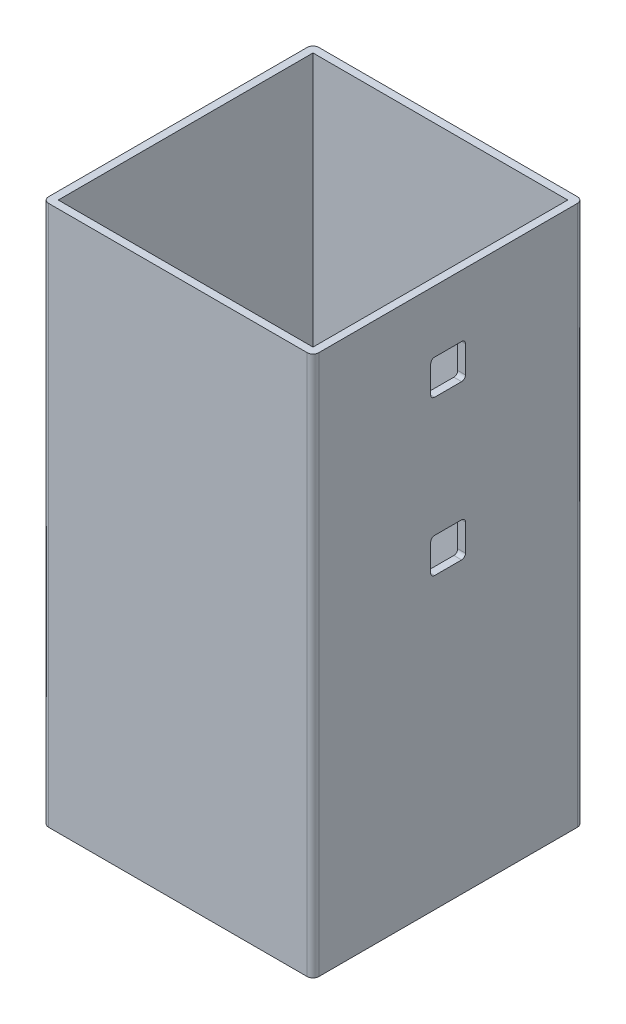
ISO-10303-21;
HEADER;
FILE_DESCRIPTION(('STEP AP214'),'2;1');
FILE_NAME('part.step','',(''),(''),'','','');
FILE_SCHEMA(('AUTOMOTIVE_DESIGN { 1 0 10303 214 1 1 1 1 }'));
ENDSEC;
DATA;
#1=APPLICATION_CONTEXT('core data for automotive mechanical design processes');
#2=APPLICATION_PROTOCOL_DEFINITION('international standard','automotive_design',2000,#1);
#3=PRODUCT_CONTEXT('',#1,'mechanical');
#4=PRODUCT('Part','Part','',(#3));
#5=PRODUCT_RELATED_PRODUCT_CATEGORY('part','',(#4));
#6=PRODUCT_DEFINITION_FORMATION('','',#4);
#7=PRODUCT_DEFINITION_CONTEXT('part definition',#1,'design');
#8=PRODUCT_DEFINITION('design','',#6,#7);
#9=PRODUCT_DEFINITION_SHAPE('','',#8);
#10=(LENGTH_UNIT() NAMED_UNIT(*) SI_UNIT(.MILLI.,.METRE.));
#11=(NAMED_UNIT(*) PLANE_ANGLE_UNIT() SI_UNIT($,.RADIAN.));
#12=(NAMED_UNIT(*) SI_UNIT($,.STERADIAN.) SOLID_ANGLE_UNIT());
#13=UNCERTAINTY_MEASURE_WITH_UNIT(LENGTH_MEASURE(1.E-05),#10,'distance_accuracy_value','');
#14=(GEOMETRIC_REPRESENTATION_CONTEXT(3) GLOBAL_UNCERTAINTY_ASSIGNED_CONTEXT((#13)) GLOBAL_UNIT_ASSIGNED_CONTEXT((#10,
#11,#12)) REPRESENTATION_CONTEXT('',''));
#15=CARTESIAN_POINT('',(0.,0.,0.));
#16=DIRECTION('',(0.,0.,1.));
#17=DIRECTION('',(1.,0.,0.));
#18=AXIS2_PLACEMENT_3D('',#15,#16,#17);
#19=CARTESIAN_POINT('',(32.,6.,3.5));
#20=DIRECTION('',(-1.,0.,0.));
#21=DIRECTION('',(0.,0.,1.));
#22=AXIS2_PLACEMENT_3D('',#19,#20,#21);
#23=CYLINDRICAL_SURFACE('',#22,1.);
#24=DIRECTION('',(1.,0.,0.));
#25=VECTOR('',#24,1.);
#26=CARTESIAN_POINT('',(32.,6.,4.5));
#27=LINE('',#26,#25);
#28=CARTESIAN_POINT('',(33.,6.,4.5));
#29=VERTEX_POINT('',#28);
#30=CARTESIAN_POINT('',(35.,6.,4.5));
#31=VERTEX_POINT('',#30);
#32=EDGE_CURVE('E179',#29,#31,#27,.T.);
#33=ORIENTED_EDGE('',*,*,#32,.T.);
#34=CARTESIAN_POINT('',(35.,6.,3.5));
#35=DIRECTION('',(-1.,0.,0.));
#36=DIRECTION('',(0.,0.,1.));
#37=AXIS2_PLACEMENT_3D('',#34,#35,#36);
#38=CIRCLE('',#37,1.);
#39=CARTESIAN_POINT('',(35.,5.,3.5));
#40=VERTEX_POINT('',#39);
#41=EDGE_CURVE('E19',#40,#31,#38,.T.);
#42=ORIENTED_EDGE('',*,*,#41,.F.);
#43=DIRECTION('',(1.,0.,0.));
#44=VECTOR('',#43,1.);
#45=CARTESIAN_POINT('',(32.,5.,3.5));
#46=LINE('',#45,#44);
#47=CARTESIAN_POINT('',(33.,5.,3.5));
#48=VERTEX_POINT('',#47);
#49=EDGE_CURVE('E273',#40,#48,#46,.F.);
#50=ORIENTED_EDGE('',*,*,#49,.T.);
#51=CARTESIAN_POINT('',(33.,6.,3.5));
#52=DIRECTION('',(-1.,0.,0.));
#53=DIRECTION('',(0.,0.,1.));
#54=AXIS2_PLACEMENT_3D('',#51,#52,#53);
#55=CIRCLE('',#54,1.);
#56=EDGE_CURVE('E177',#29,#48,#55,.F.);
#57=ORIENTED_EDGE('',*,*,#56,.F.);
#58=EDGE_LOOP('',(#33,#42,#50,#57));
#59=FACE_BOUND('',#58,.T.);
#60=ADVANCED_FACE('F16',(#59),#23,.F.);
#61=CARTESIAN_POINT('',(32.,6.,-3.5));
#62=DIRECTION('',(-1.,0.,0.));
#63=DIRECTION('',(0.,0.,1.));
#64=AXIS2_PLACEMENT_3D('',#61,#62,#63);
#65=CYLINDRICAL_SURFACE('',#64,1.);
#66=DIRECTION('',(1.,0.,0.));
#67=VECTOR('',#66,1.);
#68=CARTESIAN_POINT('',(32.,5.,-3.5));
#69=LINE('',#68,#67);
#70=CARTESIAN_POINT('',(33.,5.,-3.5));
#71=VERTEX_POINT('',#70);
#72=CARTESIAN_POINT('',(35.,5.,-3.5));
#73=VERTEX_POINT('',#72);
#74=EDGE_CURVE('E272',#71,#73,#69,.T.);
#75=ORIENTED_EDGE('',*,*,#74,.T.);
#76=CARTESIAN_POINT('',(35.,6.,-3.5));
#77=DIRECTION('',(-1.,0.,0.));
#78=DIRECTION('',(0.,0.,1.));
#79=AXIS2_PLACEMENT_3D('',#76,#77,#78);
#80=CIRCLE('',#79,1.);
#81=CARTESIAN_POINT('',(35.,6.,-4.5));
#82=VERTEX_POINT('',#81);
#83=EDGE_CURVE('E332',#82,#73,#80,.T.);
#84=ORIENTED_EDGE('',*,*,#83,.F.);
#85=DIRECTION('',(1.,0.,0.));
#86=VECTOR('',#85,1.);
#87=CARTESIAN_POINT('',(32.,6.,-4.5));
#88=LINE('',#87,#86);
#89=CARTESIAN_POINT('',(33.,6.,-4.5));
#90=VERTEX_POINT('',#89);
#91=EDGE_CURVE('E266',#82,#90,#88,.F.);
#92=ORIENTED_EDGE('',*,*,#91,.T.);
#93=CARTESIAN_POINT('',(33.,6.,-3.5));
#94=DIRECTION('',(-1.,0.,0.));
#95=DIRECTION('',(0.,0.,1.));
#96=AXIS2_PLACEMENT_3D('',#93,#94,#95);
#97=CIRCLE('',#96,1.);
#98=EDGE_CURVE('E330',#71,#90,#97,.F.);
#99=ORIENTED_EDGE('',*,*,#98,.F.);
#100=EDGE_LOOP('',(#75,#84,#92,#99));
#101=FACE_BOUND('',#100,.T.);
#102=ADVANCED_FACE('F340',(#101),#65,.F.);
#103=CARTESIAN_POINT('',(32.,13.,3.5));
#104=DIRECTION('',(-1.,0.,0.));
#105=DIRECTION('',(0.,0.,1.));
#106=AXIS2_PLACEMENT_3D('',#103,#104,#105);
#107=CYLINDRICAL_SURFACE('',#106,1.);
#108=DIRECTION('',(1.,0.,0.));
#109=VECTOR('',#108,1.);
#110=CARTESIAN_POINT('',(32.,14.,3.5));
#111=LINE('',#110,#109);
#112=CARTESIAN_POINT('',(33.,14.,3.5));
#113=VERTEX_POINT('',#112);
#114=CARTESIAN_POINT('',(35.,14.,3.5));
#115=VERTEX_POINT('',#114);
#116=EDGE_CURVE('E263',#113,#115,#111,.T.);
#117=ORIENTED_EDGE('',*,*,#116,.T.);
#118=CARTESIAN_POINT('',(35.,13.,3.5));
#119=DIRECTION('',(-1.,0.,0.));
#120=DIRECTION('',(0.,0.,1.));
#121=AXIS2_PLACEMENT_3D('',#118,#119,#120);
#122=CIRCLE('',#121,1.);
#123=CARTESIAN_POINT('',(35.,13.,4.5));
#124=VERTEX_POINT('',#123);
#125=EDGE_CURVE('E328',#124,#115,#122,.T.);
#126=ORIENTED_EDGE('',*,*,#125,.F.);
#127=DIRECTION('',(1.,0.,0.));
#128=VECTOR('',#127,1.);
#129=CARTESIAN_POINT('',(32.,13.,4.5));
#130=LINE('',#129,#128);
#131=CARTESIAN_POINT('',(33.,13.,4.5));
#132=VERTEX_POINT('',#131);
#133=EDGE_CURVE('E183',#124,#132,#130,.F.);
#134=ORIENTED_EDGE('',*,*,#133,.T.);
#135=CARTESIAN_POINT('',(33.,13.,3.5));
#136=DIRECTION('',(-1.,0.,0.));
#137=DIRECTION('',(0.,0.,1.));
#138=AXIS2_PLACEMENT_3D('',#135,#136,#137);
#139=CIRCLE('',#138,1.);
#140=EDGE_CURVE('E326',#113,#132,#139,.F.);
#141=ORIENTED_EDGE('',*,*,#140,.F.);
#142=EDGE_LOOP('',(#117,#126,#134,#141));
#143=FACE_BOUND('',#142,.T.);
#144=ADVANCED_FACE('F358',(#143),#107,.F.);
#145=CARTESIAN_POINT('',(32.,13.,-3.5));
#146=DIRECTION('',(-1.,0.,0.));
#147=DIRECTION('',(0.,0.,1.));
#148=AXIS2_PLACEMENT_3D('',#145,#146,#147);
#149=CYLINDRICAL_SURFACE('',#148,1.);
#150=DIRECTION('',(1.,0.,0.));
#151=VECTOR('',#150,1.);
#152=CARTESIAN_POINT('',(32.,13.,-4.5));
#153=LINE('',#152,#151);
#154=CARTESIAN_POINT('',(33.,13.,-4.5));
#155=VERTEX_POINT('',#154);
#156=CARTESIAN_POINT('',(35.,13.,-4.5));
#157=VERTEX_POINT('',#156);
#158=EDGE_CURVE('E269',#155,#157,#153,.T.);
#159=ORIENTED_EDGE('',*,*,#158,.T.);
#160=CARTESIAN_POINT('',(35.,13.,-3.5));
#161=DIRECTION('',(-1.,0.,0.));
#162=DIRECTION('',(0.,0.,1.));
#163=AXIS2_PLACEMENT_3D('',#160,#161,#162);
#164=CIRCLE('',#163,1.);
#165=CARTESIAN_POINT('',(35.,14.,-3.5));
#166=VERTEX_POINT('',#165);
#167=EDGE_CURVE('E324',#166,#157,#164,.T.);
#168=ORIENTED_EDGE('',*,*,#167,.F.);
#169=DIRECTION('',(1.,0.,0.));
#170=VECTOR('',#169,1.);
#171=CARTESIAN_POINT('',(32.,14.,-3.5));
#172=LINE('',#171,#170);
#173=CARTESIAN_POINT('',(33.,14.,-3.5));
#174=VERTEX_POINT('',#173);
#175=EDGE_CURVE('E258',#166,#174,#172,.F.);
#176=ORIENTED_EDGE('',*,*,#175,.T.);
#177=CARTESIAN_POINT('',(33.,13.,-3.5));
#178=DIRECTION('',(-1.,0.,0.));
#179=DIRECTION('',(0.,0.,1.));
#180=AXIS2_PLACEMENT_3D('',#177,#178,#179);
#181=CIRCLE('',#180,1.);
#182=EDGE_CURVE('E322',#155,#174,#181,.F.);
#183=ORIENTED_EDGE('',*,*,#182,.F.);
#184=EDGE_LOOP('',(#159,#168,#176,#183));
#185=FACE_BOUND('',#184,.T.);
#186=ADVANCED_FACE('F350',(#185),#149,.F.);
#187=CARTESIAN_POINT('',(32.,46.,3.5));
#188=DIRECTION('',(-1.,0.,0.));
#189=DIRECTION('',(0.,0.,1.));
#190=AXIS2_PLACEMENT_3D('',#187,#188,#189);
#191=CYLINDRICAL_SURFACE('',#190,1.);
#192=DIRECTION('',(1.,0.,0.));
#193=VECTOR('',#192,1.);
#194=CARTESIAN_POINT('',(32.,46.,4.5));
#195=LINE('',#194,#193);
#196=CARTESIAN_POINT('',(33.,46.,4.5));
#197=VERTEX_POINT('',#196);
#198=CARTESIAN_POINT('',(35.,46.,4.5));
#199=VERTEX_POINT('',#198);
#200=EDGE_CURVE('E254',#197,#199,#195,.T.);
#201=ORIENTED_EDGE('',*,*,#200,.T.);
#202=CARTESIAN_POINT('',(35.,46.,3.5));
#203=DIRECTION('',(-1.,0.,0.));
#204=DIRECTION('',(0.,0.,1.));
#205=AXIS2_PLACEMENT_3D('',#202,#203,#204);
#206=CIRCLE('',#205,1.);
#207=CARTESIAN_POINT('',(35.,45.,3.5));
#208=VERTEX_POINT('',#207);
#209=EDGE_CURVE('E320',#208,#199,#206,.T.);
#210=ORIENTED_EDGE('',*,*,#209,.F.);
#211=DIRECTION('',(1.,0.,0.));
#212=VECTOR('',#211,1.);
#213=CARTESIAN_POINT('',(32.,45.,3.5));
#214=LINE('',#213,#212);
#215=CARTESIAN_POINT('',(33.,45.,3.5));
#216=VERTEX_POINT('',#215);
#217=EDGE_CURVE('E246',#208,#216,#214,.F.);
#218=ORIENTED_EDGE('',*,*,#217,.T.);
#219=CARTESIAN_POINT('',(33.,46.,3.5));
#220=DIRECTION('',(-1.,0.,0.));
#221=DIRECTION('',(0.,0.,1.));
#222=AXIS2_PLACEMENT_3D('',#219,#220,#221);
#223=CIRCLE('',#222,1.);
#224=EDGE_CURVE('E318',#197,#216,#223,.F.);
#225=ORIENTED_EDGE('',*,*,#224,.F.);
#226=EDGE_LOOP('',(#201,#210,#218,#225));
#227=FACE_BOUND('',#226,.T.);
#228=ADVANCED_FACE('F706',(#227),#191,.F.);
#229=CARTESIAN_POINT('',(32.,46.,-3.5));
#230=DIRECTION('',(-1.,0.,0.));
#231=DIRECTION('',(0.,0.,1.));
#232=AXIS2_PLACEMENT_3D('',#229,#230,#231);
#233=CYLINDRICAL_SURFACE('',#232,1.);
#234=DIRECTION('',(1.,0.,0.));
#235=VECTOR('',#234,1.);
#236=CARTESIAN_POINT('',(32.,45.,-3.5));
#237=LINE('',#236,#235);
#238=CARTESIAN_POINT('',(33.,45.,-3.5));
#239=VERTEX_POINT('',#238);
#240=CARTESIAN_POINT('',(35.,45.,-3.5));
#241=VERTEX_POINT('',#240);
#242=EDGE_CURVE('E251',#239,#241,#237,.T.);
#243=ORIENTED_EDGE('',*,*,#242,.T.);
#244=CARTESIAN_POINT('',(35.,46.,-3.5));
#245=DIRECTION('',(-1.,0.,0.));
#246=DIRECTION('',(0.,0.,1.));
#247=AXIS2_PLACEMENT_3D('',#244,#245,#246);
#248=CIRCLE('',#247,1.);
#249=CARTESIAN_POINT('',(35.,46.,-4.5));
#250=VERTEX_POINT('',#249);
#251=EDGE_CURVE('E316',#250,#241,#248,.T.);
#252=ORIENTED_EDGE('',*,*,#251,.F.);
#253=DIRECTION('',(1.,0.,0.));
#254=VECTOR('',#253,1.);
#255=CARTESIAN_POINT('',(32.,46.,-4.5));
#256=LINE('',#255,#254);
#257=CARTESIAN_POINT('',(33.,46.,-4.5));
#258=VERTEX_POINT('',#257);
#259=EDGE_CURVE('E243',#250,#258,#256,.F.);
#260=ORIENTED_EDGE('',*,*,#259,.T.);
#261=CARTESIAN_POINT('',(33.,46.,-3.5));
#262=DIRECTION('',(-1.,0.,0.));
#263=DIRECTION('',(0.,0.,1.));
#264=AXIS2_PLACEMENT_3D('',#261,#262,#263);
#265=CIRCLE('',#264,1.);
#266=EDGE_CURVE('E314',#239,#258,#265,.F.);
#267=ORIENTED_EDGE('',*,*,#266,.F.);
#268=EDGE_LOOP('',(#243,#252,#260,#267));
#269=FACE_BOUND('',#268,.T.);
#270=ADVANCED_FACE('F696',(#269),#233,.F.);
#271=CARTESIAN_POINT('',(32.,53.,-3.5));
#272=DIRECTION('',(-1.,0.,0.));
#273=DIRECTION('',(0.,0.,1.));
#274=AXIS2_PLACEMENT_3D('',#271,#272,#273);
#275=CYLINDRICAL_SURFACE('',#274,1.);
#276=DIRECTION('',(1.,0.,0.));
#277=VECTOR('',#276,1.);
#278=CARTESIAN_POINT('',(32.,53.,-4.5));
#279=LINE('',#278,#277);
#280=CARTESIAN_POINT('',(33.,53.,-4.5));
#281=VERTEX_POINT('',#280);
#282=CARTESIAN_POINT('',(35.,53.,-4.5));
#283=VERTEX_POINT('',#282);
#284=EDGE_CURVE('E240',#281,#283,#279,.T.);
#285=ORIENTED_EDGE('',*,*,#284,.T.);
#286=CARTESIAN_POINT('',(35.,53.,-3.5));
#287=DIRECTION('',(-1.,0.,0.));
#288=DIRECTION('',(0.,0.,1.));
#289=AXIS2_PLACEMENT_3D('',#286,#287,#288);
#290=CIRCLE('',#289,1.);
#291=CARTESIAN_POINT('',(35.,54.,-3.5));
#292=VERTEX_POINT('',#291);
#293=EDGE_CURVE('E312',#292,#283,#290,.T.);
#294=ORIENTED_EDGE('',*,*,#293,.F.);
#295=DIRECTION('',(1.,0.,0.));
#296=VECTOR('',#295,1.);
#297=CARTESIAN_POINT('',(32.,54.,-3.5));
#298=LINE('',#297,#296);
#299=CARTESIAN_POINT('',(33.,54.,-3.5));
#300=VERTEX_POINT('',#299);
#301=EDGE_CURVE('E237',#292,#300,#298,.F.);
#302=ORIENTED_EDGE('',*,*,#301,.T.);
#303=CARTESIAN_POINT('',(33.,53.,-3.5));
#304=DIRECTION('',(-1.,0.,0.));
#305=DIRECTION('',(0.,0.,1.));
#306=AXIS2_PLACEMENT_3D('',#303,#304,#305);
#307=CIRCLE('',#306,1.);
#308=EDGE_CURVE('E310',#281,#300,#307,.F.);
#309=ORIENTED_EDGE('',*,*,#308,.F.);
#310=EDGE_LOOP('',(#285,#294,#302,#309));
#311=FACE_BOUND('',#310,.T.);
#312=ADVANCED_FACE('F686',(#311),#275,.F.);
#313=CARTESIAN_POINT('',(32.,53.,3.5));
#314=DIRECTION('',(-1.,0.,0.));
#315=DIRECTION('',(0.,0.,1.));
#316=AXIS2_PLACEMENT_3D('',#313,#314,#315);
#317=CYLINDRICAL_SURFACE('',#316,1.);
#318=DIRECTION('',(1.,0.,0.));
#319=VECTOR('',#318,1.);
#320=CARTESIAN_POINT('',(32.,54.,3.5));
#321=LINE('',#320,#319);
#322=CARTESIAN_POINT('',(33.,54.,3.5));
#323=VERTEX_POINT('',#322);
#324=CARTESIAN_POINT('',(35.,54.,3.5));
#325=VERTEX_POINT('',#324);
#326=EDGE_CURVE('E236',#323,#325,#321,.T.);
#327=ORIENTED_EDGE('',*,*,#326,.T.);
#328=CARTESIAN_POINT('',(35.,53.,3.5));
#329=DIRECTION('',(-1.,0.,0.));
#330=DIRECTION('',(0.,0.,1.));
#331=AXIS2_PLACEMENT_3D('',#328,#329,#330);
#332=CIRCLE('',#331,1.);
#333=CARTESIAN_POINT('',(35.,53.,4.5));
#334=VERTEX_POINT('',#333);
#335=EDGE_CURVE('E308',#334,#325,#332,.T.);
#336=ORIENTED_EDGE('',*,*,#335,.F.);
#337=DIRECTION('',(1.,0.,0.));
#338=VECTOR('',#337,1.);
#339=CARTESIAN_POINT('',(32.,53.,4.5));
#340=LINE('',#339,#338);
#341=CARTESIAN_POINT('',(33.,53.,4.5));
#342=VERTEX_POINT('',#341);
#343=EDGE_CURVE('E255',#334,#342,#340,.F.);
#344=ORIENTED_EDGE('',*,*,#343,.T.);
#345=CARTESIAN_POINT('',(33.,53.,3.5));
#346=DIRECTION('',(-1.,0.,0.));
#347=DIRECTION('',(0.,0.,1.));
#348=AXIS2_PLACEMENT_3D('',#345,#346,#347);
#349=CIRCLE('',#348,1.);
#350=EDGE_CURVE('E184',#323,#342,#349,.F.);
#351=ORIENTED_EDGE('',*,*,#350,.F.);
#352=EDGE_LOOP('',(#327,#336,#344,#351));
#353=FACE_BOUND('',#352,.T.);
#354=ADVANCED_FACE('F677',(#353),#317,.F.);
#355=CARTESIAN_POINT('',(32.,14.,4.5));
#356=DIRECTION('',(0.,0.,1.));
#357=DIRECTION('',(1.,0.,0.));
#358=AXIS2_PLACEMENT_3D('',#355,#356,#357);
#359=PLANE('',#358);
#360=ORIENTED_EDGE('',*,*,#133,.F.);
#361=DIRECTION('',(0.,1.,0.));
#362=VECTOR('',#361,1.);
#363=CARTESIAN_POINT('',(35.,70.,4.5));
#364=LINE('',#363,#362);
#365=EDGE_CURVE('E174',#124,#31,#364,.F.);
#366=ORIENTED_EDGE('',*,*,#365,.T.);
#367=ORIENTED_EDGE('',*,*,#32,.F.);
#368=DIRECTION('',(0.,1.,0.));
#369=VECTOR('',#368,1.);
#370=CARTESIAN_POINT('',(33.,-70.,4.5));
#371=LINE('',#370,#369);
#372=EDGE_CURVE('E222',#29,#132,#371,.T.);
#373=ORIENTED_EDGE('',*,*,#372,.T.);
#374=EDGE_LOOP('',(#360,#366,#367,#373));
#375=FACE_BOUND('',#374,.T.);
#376=ADVANCED_FACE('F187',(#375),#359,.F.);
#377=CARTESIAN_POINT('',(32.,5.,4.5));
#378=DIRECTION('',(0.,-1.,0.));
#379=DIRECTION('',(0.,0.,-1.));
#380=AXIS2_PLACEMENT_3D('',#377,#378,#379);
#381=PLANE('',#380);
#382=ORIENTED_EDGE('',*,*,#74,.F.);
#383=DIRECTION('',(0.,0.,-1.));
#384=VECTOR('',#383,1.);
#385=CARTESIAN_POINT('',(33.,5.,-33.));
#386=LINE('',#385,#384);
#387=EDGE_CURVE('E224',#71,#48,#386,.F.);
#388=ORIENTED_EDGE('',*,*,#387,.T.);
#389=ORIENTED_EDGE('',*,*,#49,.F.);
#390=DIRECTION('',(0.,0.,1.));
#391=VECTOR('',#390,1.);
#392=CARTESIAN_POINT('',(35.,5.,-35.));
#393=LINE('',#392,#391);
#394=EDGE_CURVE('E176',#40,#73,#393,.F.);
#395=ORIENTED_EDGE('',*,*,#394,.T.);
#396=EDGE_LOOP('',(#382,#388,#389,#395));
#397=FACE_BOUND('',#396,.T.);
#398=ADVANCED_FACE('F338',(#397),#381,.F.);
#399=CARTESIAN_POINT('',(32.,14.,-4.5));
#400=DIRECTION('',(0.,0.,-1.));
#401=DIRECTION('',(0.,1.,0.));
#402=AXIS2_PLACEMENT_3D('',#399,#400,#401);
#403=PLANE('',#402);
#404=ORIENTED_EDGE('',*,*,#91,.F.);
#405=DIRECTION('',(0.,1.,0.));
#406=VECTOR('',#405,1.);
#407=CARTESIAN_POINT('',(35.,70.,-4.5));
#408=LINE('',#407,#406);
#409=EDGE_CURVE('E191',#82,#157,#408,.T.);
#410=ORIENTED_EDGE('',*,*,#409,.T.);
#411=ORIENTED_EDGE('',*,*,#158,.F.);
#412=DIRECTION('',(0.,1.,0.));
#413=VECTOR('',#412,1.);
#414=CARTESIAN_POINT('',(33.,-70.,-4.5));
#415=LINE('',#414,#413);
#416=EDGE_CURVE('E227',#155,#90,#415,.F.);
#417=ORIENTED_EDGE('',*,*,#416,.T.);
#418=EDGE_LOOP('',(#404,#410,#411,#417));
#419=FACE_BOUND('',#418,.T.);
#420=ADVANCED_FACE('F346',(#419),#403,.F.);
#421=CARTESIAN_POINT('',(32.,14.,4.5));
#422=DIRECTION('',(0.,1.,0.));
#423=DIRECTION('',(0.,0.,1.));
#424=AXIS2_PLACEMENT_3D('',#421,#422,#423);
#425=PLANE('',#424);
#426=ORIENTED_EDGE('',*,*,#175,.F.);
#427=DIRECTION('',(0.,0.,1.));
#428=VECTOR('',#427,1.);
#429=CARTESIAN_POINT('',(35.,14.,-35.));
#430=LINE('',#429,#428);
#431=EDGE_CURVE('E359',#166,#115,#430,.T.);
#432=ORIENTED_EDGE('',*,*,#431,.T.);
#433=ORIENTED_EDGE('',*,*,#116,.F.);
#434=DIRECTION('',(0.,0.,-1.));
#435=VECTOR('',#434,1.);
#436=CARTESIAN_POINT('',(33.,14.,-33.));
#437=LINE('',#436,#435);
#438=EDGE_CURVE('E230',#113,#174,#437,.T.);
#439=ORIENTED_EDGE('',*,*,#438,.T.);
#440=EDGE_LOOP('',(#426,#432,#433,#439));
#441=FACE_BOUND('',#440,.T.);
#442=ADVANCED_FACE('F356',(#441),#425,.F.);
#443=CARTESIAN_POINT('',(32.,54.,4.5));
#444=DIRECTION('',(0.,0.,1.));
#445=DIRECTION('',(0.,-1.,0.));
#446=AXIS2_PLACEMENT_3D('',#443,#444,#445);
#447=PLANE('',#446);
#448=ORIENTED_EDGE('',*,*,#200,.F.);
#449=DIRECTION('',(0.,1.,0.));
#450=VECTOR('',#449,1.);
#451=CARTESIAN_POINT('',(33.,-70.,4.5));
#452=LINE('',#451,#450);
#453=EDGE_CURVE('E210',#197,#342,#452,.T.);
#454=ORIENTED_EDGE('',*,*,#453,.T.);
#455=ORIENTED_EDGE('',*,*,#343,.F.);
#456=DIRECTION('',(0.,1.,0.));
#457=VECTOR('',#456,1.);
#458=CARTESIAN_POINT('',(35.,70.,4.5));
#459=LINE('',#458,#457);
#460=EDGE_CURVE('E360',#334,#199,#459,.F.);
#461=ORIENTED_EDGE('',*,*,#460,.T.);
#462=EDGE_LOOP('',(#448,#454,#455,#461));
#463=FACE_BOUND('',#462,.T.);
#464=ADVANCED_FACE('F634',(#463),#447,.F.);
#465=CARTESIAN_POINT('',(32.,45.,4.5));
#466=DIRECTION('',(0.,-1.,0.));
#467=DIRECTION('',(0.,0.,-1.));
#468=AXIS2_PLACEMENT_3D('',#465,#466,#467);
#469=PLANE('',#468);
#470=ORIENTED_EDGE('',*,*,#217,.F.);
#471=DIRECTION('',(0.,0.,1.));
#472=VECTOR('',#471,1.);
#473=CARTESIAN_POINT('',(35.,45.,-35.));
#474=LINE('',#473,#472);
#475=EDGE_CURVE('E363',#208,#241,#474,.F.);
#476=ORIENTED_EDGE('',*,*,#475,.T.);
#477=ORIENTED_EDGE('',*,*,#242,.F.);
#478=DIRECTION('',(0.,0.,-1.));
#479=VECTOR('',#478,1.);
#480=CARTESIAN_POINT('',(33.,45.,-33.));
#481=LINE('',#480,#479);
#482=EDGE_CURVE('E213',#239,#216,#481,.F.);
#483=ORIENTED_EDGE('',*,*,#482,.T.);
#484=EDGE_LOOP('',(#470,#476,#477,#483));
#485=FACE_BOUND('',#484,.T.);
#486=ADVANCED_FACE('F624',(#485),#469,.F.);
#487=CARTESIAN_POINT('',(32.,54.,-4.5));
#488=DIRECTION('',(0.,0.,-1.));
#489=DIRECTION('',(0.,1.,0.));
#490=AXIS2_PLACEMENT_3D('',#487,#488,#489);
#491=PLANE('',#490);
#492=ORIENTED_EDGE('',*,*,#284,.F.);
#493=DIRECTION('',(0.,1.,0.));
#494=VECTOR('',#493,1.);
#495=CARTESIAN_POINT('',(33.,-70.,-4.5));
#496=LINE('',#495,#494);
#497=EDGE_CURVE('E216',#281,#258,#496,.F.);
#498=ORIENTED_EDGE('',*,*,#497,.T.);
#499=ORIENTED_EDGE('',*,*,#259,.F.);
#500=DIRECTION('',(0.,1.,0.));
#501=VECTOR('',#500,1.);
#502=CARTESIAN_POINT('',(35.,70.,-4.5));
#503=LINE('',#502,#501);
#504=EDGE_CURVE('E368',#250,#283,#503,.T.);
#505=ORIENTED_EDGE('',*,*,#504,.T.);
#506=EDGE_LOOP('',(#492,#498,#499,#505));
#507=FACE_BOUND('',#506,.T.);
#508=ADVANCED_FACE('F614',(#507),#491,.F.);
#509=CARTESIAN_POINT('',(32.,54.,4.5));
#510=DIRECTION('',(0.,1.,0.));
#511=DIRECTION('',(0.,0.,1.));
#512=AXIS2_PLACEMENT_3D('',#509,#510,#511);
#513=PLANE('',#512);
#514=ORIENTED_EDGE('',*,*,#326,.F.);
#515=DIRECTION('',(0.,0.,-1.));
#516=VECTOR('',#515,1.);
#517=CARTESIAN_POINT('',(33.,54.,-33.));
#518=LINE('',#517,#516);
#519=EDGE_CURVE('E219',#323,#300,#518,.T.);
#520=ORIENTED_EDGE('',*,*,#519,.T.);
#521=ORIENTED_EDGE('',*,*,#301,.F.);
#522=DIRECTION('',(0.,0.,1.));
#523=VECTOR('',#522,1.);
#524=CARTESIAN_POINT('',(35.,54.,-35.));
#525=LINE('',#524,#523);
#526=EDGE_CURVE('E200',#292,#325,#525,.T.);
#527=ORIENTED_EDGE('',*,*,#526,.T.);
#528=EDGE_LOOP('',(#514,#520,#521,#527));
#529=FACE_BOUND('',#528,.T.);
#530=ADVANCED_FACE('F506',(#529),#513,.F.);
#531=CARTESIAN_POINT('',(-33.,-70.,-33.));
#532=DIRECTION('',(-1.,0.,0.));
#533=DIRECTION('',(0.,0.,1.));
#534=AXIS2_PLACEMENT_3D('',#531,#532,#533);
#535=PLANE('',#534);
#536=DIRECTION('',(0.,0.,-1.));
#537=VECTOR('',#536,1.);
#538=CARTESIAN_POINT('',(-33.,-70.,0.));
#539=LINE('',#538,#537);
#540=CARTESIAN_POINT('',(-33.,-70.,-33.));
#541=VERTEX_POINT('',#540);
#542=CARTESIAN_POINT('',(-33.,-70.,33.));
#543=VERTEX_POINT('',#542);
#544=EDGE_CURVE('E375',#541,#543,#539,.F.);
#545=ORIENTED_EDGE('',*,*,#544,.F.);
#546=DIRECTION('',(0.,1.,0.));
#547=VECTOR('',#546,1.);
#548=CARTESIAN_POINT('',(-33.,-70.,-33.));
#549=LINE('',#548,#547);
#550=CARTESIAN_POINT('',(-33.,70.,-33.));
#551=VERTEX_POINT('',#550);
#552=EDGE_CURVE('E193',#541,#551,#549,.T.);
#553=ORIENTED_EDGE('',*,*,#552,.T.);
#554=DIRECTION('',(0.,0.,-1.));
#555=VECTOR('',#554,1.);
#556=CARTESIAN_POINT('',(-33.,70.,0.));
#557=LINE('',#556,#555);
#558=CARTESIAN_POINT('',(-33.,70.,33.));
#559=VERTEX_POINT('',#558);
#560=EDGE_CURVE('E389',#551,#559,#557,.F.);
#561=ORIENTED_EDGE('',*,*,#560,.T.);
#562=DIRECTION('',(0.,1.,0.));
#563=VECTOR('',#562,1.);
#564=CARTESIAN_POINT('',(-33.,-70.,33.));
#565=LINE('',#564,#563);
#566=EDGE_CURVE('E233',#559,#543,#565,.F.);
#567=ORIENTED_EDGE('',*,*,#566,.T.);
#568=EDGE_LOOP('',(#545,#553,#561,#567));
#569=FACE_BOUND('',#568,.T.);
#570=ADVANCED_FACE('F493',(#569),#535,.F.);
#571=CARTESIAN_POINT('',(33.,-70.,33.));
#572=DIRECTION('',(0.,0.,1.));
#573=DIRECTION('',(1.,0.,0.));
#574=AXIS2_PLACEMENT_3D('',#571,#572,#573);
#575=PLANE('',#574);
#576=DIRECTION('',(1.,0.,0.));
#577=VECTOR('',#576,1.);
#578=CARTESIAN_POINT('',(0.,-70.,33.));
#579=LINE('',#578,#577);
#580=CARTESIAN_POINT('',(33.,-70.,33.));
#581=VERTEX_POINT('',#580);
#582=EDGE_CURVE('E408',#543,#581,#579,.T.);
#583=ORIENTED_EDGE('',*,*,#582,.F.);
#584=ORIENTED_EDGE('',*,*,#566,.F.);
#585=DIRECTION('',(1.,0.,0.));
#586=VECTOR('',#585,1.);
#587=CARTESIAN_POINT('',(0.,70.,33.));
#588=LINE('',#587,#586);
#589=CARTESIAN_POINT('',(33.,70.,33.));
#590=VERTEX_POINT('',#589);
#591=EDGE_CURVE('E306',#559,#590,#588,.T.);
#592=ORIENTED_EDGE('',*,*,#591,.T.);
#593=DIRECTION('',(0.,1.,0.));
#594=VECTOR('',#593,1.);
#595=CARTESIAN_POINT('',(33.,-70.,33.));
#596=LINE('',#595,#594);
#597=EDGE_CURVE('E207',#590,#581,#596,.F.);
#598=ORIENTED_EDGE('',*,*,#597,.T.);
#599=EDGE_LOOP('',(#583,#584,#592,#598));
#600=FACE_BOUND('',#599,.T.);
#601=ADVANCED_FACE('F496',(#600),#575,.F.);
#602=CARTESIAN_POINT('',(33.,-70.,-33.));
#603=DIRECTION('',(1.,0.,0.));
#604=DIRECTION('',(0.,0.,-1.));
#605=AXIS2_PLACEMENT_3D('',#602,#603,#604);
#606=PLANE('',#605);
#607=DIRECTION('',(0.,0.,-1.));
#608=VECTOR('',#607,1.);
#609=CARTESIAN_POINT('',(33.,-70.,0.));
#610=LINE('',#609,#608);
#611=CARTESIAN_POINT('',(33.,-70.,-33.));
#612=VERTEX_POINT('',#611);
#613=EDGE_CURVE('E411',#581,#612,#610,.T.);
#614=ORIENTED_EDGE('',*,*,#613,.F.);
#615=ORIENTED_EDGE('',*,*,#597,.F.);
#616=DIRECTION('',(0.,0.,-1.));
#617=VECTOR('',#616,1.);
#618=CARTESIAN_POINT('',(33.,70.,0.));
#619=LINE('',#618,#617);
#620=CARTESIAN_POINT('',(33.,70.,-33.));
#621=VERTEX_POINT('',#620);
#622=EDGE_CURVE('E379',#590,#621,#619,.T.);
#623=ORIENTED_EDGE('',*,*,#622,.T.);
#624=DIRECTION('',(0.,1.,0.));
#625=VECTOR('',#624,1.);
#626=CARTESIAN_POINT('',(33.,-70.,-33.));
#627=LINE('',#626,#625);
#628=EDGE_CURVE('E204',#621,#612,#627,.F.);
#629=ORIENTED_EDGE('',*,*,#628,.T.);
#630=EDGE_LOOP('',(#614,#615,#623,#629));
#631=FACE_BOUND('',#630,.T.);
#632=ORIENTED_EDGE('',*,*,#224,.T.);
#633=ORIENTED_EDGE('',*,*,#482,.F.);
#634=ORIENTED_EDGE('',*,*,#266,.T.);
#635=ORIENTED_EDGE('',*,*,#497,.F.);
#636=ORIENTED_EDGE('',*,*,#308,.T.);
#637=ORIENTED_EDGE('',*,*,#519,.F.);
#638=ORIENTED_EDGE('',*,*,#350,.T.);
#639=ORIENTED_EDGE('',*,*,#453,.F.);
#640=EDGE_LOOP('',(#632,#633,#634,#635,#636,#637,#638,#639));
#641=FACE_BOUND('',#640,.T.);
#642=ORIENTED_EDGE('',*,*,#56,.T.);
#643=ORIENTED_EDGE('',*,*,#387,.F.);
#644=ORIENTED_EDGE('',*,*,#98,.T.);
#645=ORIENTED_EDGE('',*,*,#416,.F.);
#646=ORIENTED_EDGE('',*,*,#182,.T.);
#647=ORIENTED_EDGE('',*,*,#438,.F.);
#648=ORIENTED_EDGE('',*,*,#140,.T.);
#649=ORIENTED_EDGE('',*,*,#372,.F.);
#650=EDGE_LOOP('',(#642,#643,#644,#645,#646,#647,#648,#649));
#651=FACE_BOUND('',#650,.T.);
#652=ADVANCED_FACE('F335',(#631,#641,#651),#606,.F.);
#653=CARTESIAN_POINT('',(33.,-70.,-33.));
#654=DIRECTION('',(0.,0.,-1.));
#655=DIRECTION('',(-1.,0.,0.));
#656=AXIS2_PLACEMENT_3D('',#653,#654,#655);
#657=PLANE('',#656);
#658=DIRECTION('',(1.,0.,0.));
#659=VECTOR('',#658,1.);
#660=CARTESIAN_POINT('',(0.,-70.,-33.));
#661=LINE('',#660,#659);
#662=EDGE_CURVE('E414',#612,#541,#661,.F.);
#663=ORIENTED_EDGE('',*,*,#662,.F.);
#664=ORIENTED_EDGE('',*,*,#628,.F.);
#665=DIRECTION('',(1.,0.,0.));
#666=VECTOR('',#665,1.);
#667=CARTESIAN_POINT('',(0.,70.,-33.));
#668=LINE('',#667,#666);
#669=EDGE_CURVE('E386',#621,#551,#668,.F.);
#670=ORIENTED_EDGE('',*,*,#669,.T.);
#671=ORIENTED_EDGE('',*,*,#552,.F.);
#672=EDGE_LOOP('',(#663,#664,#670,#671));
#673=FACE_BOUND('',#672,.T.);
#674=ADVANCED_FACE('F490',(#673),#657,.F.);
#675=CARTESIAN_POINT('',(35.,70.,-35.));
#676=DIRECTION('',(0.,0.,1.));
#677=DIRECTION('',(1.,0.,0.));
#678=AXIS2_PLACEMENT_3D('',#675,#676,#677);
#679=PLANE('',#678);
#680=DIRECTION('',(0.,-1.,0.));
#681=VECTOR('',#680,1.);
#682=CARTESIAN_POINT('',(33.5,70.,-35.));
#683=LINE('',#682,#681);
#684=CARTESIAN_POINT('',(33.5,-70.,-35.));
#685=VERTEX_POINT('',#684);
#686=CARTESIAN_POINT('',(33.5,70.,-35.));
#687=VERTEX_POINT('',#686);
#688=EDGE_CURVE('E189',#685,#687,#683,.F.);
#689=ORIENTED_EDGE('',*,*,#688,.F.);
#690=DIRECTION('',(1.,0.,0.));
#691=VECTOR('',#690,1.);
#692=CARTESIAN_POINT('',(0.,-70.,-35.));
#693=LINE('',#692,#691);
#694=CARTESIAN_POINT('',(-33.5,-70.,-35.));
#695=VERTEX_POINT('',#694);
#696=EDGE_CURVE('E290',#695,#685,#693,.T.);
#697=ORIENTED_EDGE('',*,*,#696,.F.);
#698=DIRECTION('',(0.,-1.,0.));
#699=VECTOR('',#698,1.);
#700=CARTESIAN_POINT('',(-33.5,70.,-35.));
#701=LINE('',#700,#699);
#702=CARTESIAN_POINT('',(-33.5,70.,-35.));
#703=VERTEX_POINT('',#702);
#704=EDGE_CURVE('E199',#703,#695,#701,.T.);
#705=ORIENTED_EDGE('',*,*,#704,.F.);
#706=DIRECTION('',(1.,0.,0.));
#707=VECTOR('',#706,1.);
#708=CARTESIAN_POINT('',(0.,70.,-35.));
#709=LINE('',#708,#707);
#710=EDGE_CURVE('E298',#703,#687,#709,.T.);
#711=ORIENTED_EDGE('',*,*,#710,.T.);
#712=EDGE_LOOP('',(#689,#697,#705,#711));
#713=FACE_BOUND('',#712,.T.);
#714=ADVANCED_FACE('F441',(#713),#679,.F.);
#715=CARTESIAN_POINT('',(33.5,70.,-33.5));
#716=DIRECTION('',(0.,-1.,0.));
#717=DIRECTION('',(0.,0.,-1.));
#718=AXIS2_PLACEMENT_3D('',#715,#716,#717);
#719=CYLINDRICAL_SURFACE('',#718,1.5);
#720=CARTESIAN_POINT('',(33.5,-70.,-33.5));
#721=DIRECTION('',(0.,-1.,0.));
#722=DIRECTION('',(0.,0.,-1.));
#723=AXIS2_PLACEMENT_3D('',#720,#721,#722);
#724=CIRCLE('',#723,1.5);
#725=CARTESIAN_POINT('',(35.,-70.,-33.5));
#726=VERTEX_POINT('',#725);
#727=EDGE_CURVE('E288',#685,#726,#724,.T.);
#728=ORIENTED_EDGE('',*,*,#727,.F.);
#729=ORIENTED_EDGE('',*,*,#688,.T.);
#730=CARTESIAN_POINT('',(33.5,70.,-33.5));
#731=DIRECTION('',(0.,-1.,0.));
#732=DIRECTION('',(0.,0.,-1.));
#733=AXIS2_PLACEMENT_3D('',#730,#731,#732);
#734=CIRCLE('',#733,1.5);
#735=CARTESIAN_POINT('',(35.,70.,-33.5));
#736=VERTEX_POINT('',#735);
#737=EDGE_CURVE('E295',#687,#736,#734,.T.);
#738=ORIENTED_EDGE('',*,*,#737,.T.);
#739=DIRECTION('',(0.,1.,0.));
#740=VECTOR('',#739,1.);
#741=CARTESIAN_POINT('',(35.,70.,-33.5));
#742=LINE('',#741,#740);
#743=EDGE_CURVE('E197',#736,#726,#742,.F.);
#744=ORIENTED_EDGE('',*,*,#743,.T.);
#745=EDGE_LOOP('',(#728,#729,#738,#744));
#746=FACE_BOUND('',#745,.T.);
#747=ADVANCED_FACE('F450',(#746),#719,.T.);
#748=CARTESIAN_POINT('',(35.,70.,-35.));
#749=DIRECTION('',(-1.,0.,0.));
#750=DIRECTION('',(0.,0.,1.));
#751=AXIS2_PLACEMENT_3D('',#748,#749,#750);
#752=PLANE('',#751);
#753=ORIENTED_EDGE('',*,*,#743,.F.);
#754=DIRECTION('',(0.,0.,-1.));
#755=VECTOR('',#754,1.);
#756=CARTESIAN_POINT('',(35.,70.,0.));
#757=LINE('',#756,#755);
#758=CARTESIAN_POINT('',(35.,70.,33.5));
#759=VERTEX_POINT('',#758);
#760=EDGE_CURVE('E294',#736,#759,#757,.F.);
#761=ORIENTED_EDGE('',*,*,#760,.T.);
#762=DIRECTION('',(0.,-1.,0.));
#763=VECTOR('',#762,1.);
#764=CARTESIAN_POINT('',(35.,70.,33.5));
#765=LINE('',#764,#763);
#766=CARTESIAN_POINT('',(35.,-70.,33.5));
#767=VERTEX_POINT('',#766);
#768=EDGE_CURVE('E293',#767,#759,#765,.F.);
#769=ORIENTED_EDGE('',*,*,#768,.F.);
#770=DIRECTION('',(0.,0.,-1.));
#771=VECTOR('',#770,1.);
#772=CARTESIAN_POINT('',(35.,-70.,0.));
#773=LINE('',#772,#771);
#774=EDGE_CURVE('E287',#726,#767,#773,.F.);
#775=ORIENTED_EDGE('',*,*,#774,.F.);
#776=EDGE_LOOP('',(#753,#761,#769,#775));
#777=FACE_BOUND('',#776,.T.);
#778=ORIENTED_EDGE('',*,*,#293,.T.);
#779=ORIENTED_EDGE('',*,*,#504,.F.);
#780=ORIENTED_EDGE('',*,*,#251,.T.);
#781=ORIENTED_EDGE('',*,*,#475,.F.);
#782=ORIENTED_EDGE('',*,*,#209,.T.);
#783=ORIENTED_EDGE('',*,*,#460,.F.);
#784=ORIENTED_EDGE('',*,*,#335,.T.);
#785=ORIENTED_EDGE('',*,*,#526,.F.);
#786=EDGE_LOOP('',(#778,#779,#780,#781,#782,#783,#784,#785));
#787=FACE_BOUND('',#786,.T.);
#788=ORIENTED_EDGE('',*,*,#167,.T.);
#789=ORIENTED_EDGE('',*,*,#409,.F.);
#790=ORIENTED_EDGE('',*,*,#83,.T.);
#791=ORIENTED_EDGE('',*,*,#394,.F.);
#792=ORIENTED_EDGE('',*,*,#41,.T.);
#793=ORIENTED_EDGE('',*,*,#365,.F.);
#794=ORIENTED_EDGE('',*,*,#125,.T.);
#795=ORIENTED_EDGE('',*,*,#431,.F.);
#796=EDGE_LOOP('',(#788,#789,#790,#791,#792,#793,#794,#795));
#797=FACE_BOUND('',#796,.T.);
#798=ADVANCED_FACE('F172',(#777,#787,#797),#752,.F.);
#799=CARTESIAN_POINT('',(-35.,70.,-35.));
#800=DIRECTION('',(1.,0.,0.));
#801=DIRECTION('',(0.,0.,-1.));
#802=AXIS2_PLACEMENT_3D('',#799,#800,#801);
#803=PLANE('',#802);
#804=DIRECTION('',(0.,-1.,0.));
#805=VECTOR('',#804,1.);
#806=CARTESIAN_POINT('',(-35.,70.,-33.5));
#807=LINE('',#806,#805);
#808=CARTESIAN_POINT('',(-35.,-70.,-33.5));
#809=VERTEX_POINT('',#808);
#810=CARTESIAN_POINT('',(-35.,70.,-33.5));
#811=VERTEX_POINT('',#810);
#812=EDGE_CURVE('E380',#809,#811,#807,.F.);
#813=ORIENTED_EDGE('',*,*,#812,.F.);
#814=DIRECTION('',(0.,0.,-1.));
#815=VECTOR('',#814,1.);
#816=CARTESIAN_POINT('',(-35.,-70.,0.));
#817=LINE('',#816,#815);
#818=CARTESIAN_POINT('',(-35.,-70.,33.5));
#819=VERTEX_POINT('',#818);
#820=EDGE_CURVE('E282',#819,#809,#817,.T.);
#821=ORIENTED_EDGE('',*,*,#820,.F.);
#822=DIRECTION('',(0.,-1.,0.));
#823=VECTOR('',#822,1.);
#824=CARTESIAN_POINT('',(-35.,70.,33.5));
#825=LINE('',#824,#823);
#826=CARTESIAN_POINT('',(-35.,70.,33.5));
#827=VERTEX_POINT('',#826);
#828=EDGE_CURVE('E376',#827,#819,#825,.T.);
#829=ORIENTED_EDGE('',*,*,#828,.F.);
#830=DIRECTION('',(0.,0.,-1.));
#831=VECTOR('',#830,1.);
#832=CARTESIAN_POINT('',(-35.,70.,0.));
#833=LINE('',#832,#831);
#834=EDGE_CURVE('E302',#827,#811,#833,.T.);
#835=ORIENTED_EDGE('',*,*,#834,.T.);
#836=EDGE_LOOP('',(#813,#821,#829,#835));
#837=FACE_BOUND('',#836,.T.);
#838=ADVANCED_FACE('F431',(#837),#803,.F.);
#839=CARTESIAN_POINT('',(-33.5,70.,-33.5));
#840=DIRECTION('',(0.,-1.,0.));
#841=DIRECTION('',(0.,0.,-1.));
#842=AXIS2_PLACEMENT_3D('',#839,#840,#841);
#843=CYLINDRICAL_SURFACE('',#842,1.5);
#844=CARTESIAN_POINT('',(-33.5,-70.,-33.5));
#845=DIRECTION('',(0.,-1.,0.));
#846=DIRECTION('',(0.,0.,-1.));
#847=AXIS2_PLACEMENT_3D('',#844,#845,#846);
#848=CIRCLE('',#847,1.5);
#849=EDGE_CURVE('E278',#809,#695,#848,.T.);
#850=ORIENTED_EDGE('',*,*,#849,.F.);
#851=ORIENTED_EDGE('',*,*,#812,.T.);
#852=CARTESIAN_POINT('',(-33.5,70.,-33.5));
#853=DIRECTION('',(0.,-1.,0.));
#854=DIRECTION('',(0.,0.,-1.));
#855=AXIS2_PLACEMENT_3D('',#852,#853,#854);
#856=CIRCLE('',#855,1.5);
#857=EDGE_CURVE('E299',#811,#703,#856,.T.);
#858=ORIENTED_EDGE('',*,*,#857,.T.);
#859=ORIENTED_EDGE('',*,*,#704,.T.);
#860=EDGE_LOOP('',(#850,#851,#858,#859));
#861=FACE_BOUND('',#860,.T.);
#862=ADVANCED_FACE('F435',(#861),#843,.T.);
#863=CARTESIAN_POINT('',(-33.5,70.,33.5));
#864=DIRECTION('',(0.,-1.,0.));
#865=DIRECTION('',(0.,0.,-1.));
#866=AXIS2_PLACEMENT_3D('',#863,#864,#865);
#867=CYLINDRICAL_SURFACE('',#866,1.5);
#868=CARTESIAN_POINT('',(-33.5,-70.,33.5));
#869=DIRECTION('',(0.,-1.,0.));
#870=DIRECTION('',(0.,0.,-1.));
#871=AXIS2_PLACEMENT_3D('',#868,#869,#870);
#872=CIRCLE('',#871,1.5);
#873=CARTESIAN_POINT('',(-33.5,-70.,35.));
#874=VERTEX_POINT('',#873);
#875=EDGE_CURVE('E283',#874,#819,#872,.T.);
#876=ORIENTED_EDGE('',*,*,#875,.F.);
#877=DIRECTION('',(0.,1.,0.));
#878=VECTOR('',#877,1.);
#879=CARTESIAN_POINT('',(-33.5,70.,35.));
#880=LINE('',#879,#878);
#881=CARTESIAN_POINT('',(-33.5,70.,35.));
#882=VERTEX_POINT('',#881);
#883=EDGE_CURVE('E281',#874,#882,#880,.T.);
#884=ORIENTED_EDGE('',*,*,#883,.T.);
#885=CARTESIAN_POINT('',(-33.5,70.,33.5));
#886=DIRECTION('',(0.,-1.,0.));
#887=DIRECTION('',(0.,0.,-1.));
#888=AXIS2_PLACEMENT_3D('',#885,#886,#887);
#889=CIRCLE('',#888,1.5);
#890=EDGE_CURVE('E303',#882,#827,#889,.T.);
#891=ORIENTED_EDGE('',*,*,#890,.T.);
#892=ORIENTED_EDGE('',*,*,#828,.T.);
#893=EDGE_LOOP('',(#876,#884,#891,#892));
#894=FACE_BOUND('',#893,.T.);
#895=ADVANCED_FACE('F463',(#894),#867,.T.);
#896=CARTESIAN_POINT('',(0.,70.,0.));
#897=DIRECTION('',(0.,-1.,0.));
#898=DIRECTION('',(0.,0.,-1.));
#899=AXIS2_PLACEMENT_3D('',#896,#897,#898);
#900=PLANE('',#899);
#901=ORIENTED_EDGE('',*,*,#737,.F.);
#902=ORIENTED_EDGE('',*,*,#710,.F.);
#903=ORIENTED_EDGE('',*,*,#857,.F.);
#904=ORIENTED_EDGE('',*,*,#834,.F.);
#905=ORIENTED_EDGE('',*,*,#890,.F.);
#906=DIRECTION('',(-1.,0.,0.));
#907=VECTOR('',#906,1.);
#908=CARTESIAN_POINT('',(35.,70.,35.));
#909=LINE('',#908,#907);
#910=CARTESIAN_POINT('',(33.5,70.,35.));
#911=VERTEX_POINT('',#910);
#912=EDGE_CURVE('E399',#882,#911,#909,.F.);
#913=ORIENTED_EDGE('',*,*,#912,.T.);
#914=CARTESIAN_POINT('',(33.5,70.,33.5));
#915=DIRECTION('',(0.,-1.,0.));
#916=DIRECTION('',(0.,0.,-1.));
#917=AXIS2_PLACEMENT_3D('',#914,#915,#916);
#918=CIRCLE('',#917,1.5);
#919=EDGE_CURVE('E291',#759,#911,#918,.T.);
#920=ORIENTED_EDGE('',*,*,#919,.F.);
#921=ORIENTED_EDGE('',*,*,#760,.F.);
#922=EDGE_LOOP('',(#901,#902,#903,#904,#905,#913,#920,#921));
#923=FACE_BOUND('',#922,.T.);
#924=ORIENTED_EDGE('',*,*,#560,.F.);
#925=ORIENTED_EDGE('',*,*,#669,.F.);
#926=ORIENTED_EDGE('',*,*,#622,.F.);
#927=ORIENTED_EDGE('',*,*,#591,.F.);
#928=EDGE_LOOP('',(#924,#925,#926,#927));
#929=FACE_BOUND('',#928,.T.);
#930=ADVANCED_FACE('F444',(#923,#929),#900,.F.);
#931=CARTESIAN_POINT('',(33.5,70.,33.5));
#932=DIRECTION('',(0.,-1.,0.));
#933=DIRECTION('',(0.,0.,-1.));
#934=AXIS2_PLACEMENT_3D('',#931,#932,#933);
#935=CYLINDRICAL_SURFACE('',#934,1.5);
#936=CARTESIAN_POINT('',(33.5,-70.,33.5));
#937=DIRECTION('',(0.,-1.,0.));
#938=DIRECTION('',(0.,0.,-1.));
#939=AXIS2_PLACEMENT_3D('',#936,#937,#938);
#940=CIRCLE('',#939,1.5);
#941=CARTESIAN_POINT('',(33.5,-70.,35.));
#942=VERTEX_POINT('',#941);
#943=EDGE_CURVE('E33',#767,#942,#940,.T.);
#944=ORIENTED_EDGE('',*,*,#943,.F.);
#945=ORIENTED_EDGE('',*,*,#768,.T.);
#946=ORIENTED_EDGE('',*,*,#919,.T.);
#947=DIRECTION('',(0.,1.,0.));
#948=VECTOR('',#947,1.);
#949=CARTESIAN_POINT('',(33.5,70.,35.));
#950=LINE('',#949,#948);
#951=EDGE_CURVE('E25',#911,#942,#950,.F.);
#952=ORIENTED_EDGE('',*,*,#951,.T.);
#953=EDGE_LOOP('',(#944,#945,#946,#952));
#954=FACE_BOUND('',#953,.T.);
#955=ADVANCED_FACE('F456',(#954),#935,.T.);
#956=CARTESIAN_POINT('',(0.,-70.,0.));
#957=DIRECTION('',(0.,-1.,0.));
#958=DIRECTION('',(0.,0.,-1.));
#959=AXIS2_PLACEMENT_3D('',#956,#957,#958);
#960=PLANE('',#959);
#961=ORIENTED_EDGE('',*,*,#820,.T.);
#962=ORIENTED_EDGE('',*,*,#849,.T.);
#963=ORIENTED_EDGE('',*,*,#696,.T.);
#964=ORIENTED_EDGE('',*,*,#727,.T.);
#965=ORIENTED_EDGE('',*,*,#774,.T.);
#966=ORIENTED_EDGE('',*,*,#943,.T.);
#967=DIRECTION('',(-1.,0.,0.));
#968=VECTOR('',#967,1.);
#969=CARTESIAN_POINT('',(35.,-70.,35.));
#970=LINE('',#969,#968);
#971=EDGE_CURVE('E11',#942,#874,#970,.T.);
#972=ORIENTED_EDGE('',*,*,#971,.T.);
#973=ORIENTED_EDGE('',*,*,#875,.T.);
#974=EDGE_LOOP('',(#961,#962,#963,#964,#965,#966,#972,#973));
#975=FACE_BOUND('',#974,.T.);
#976=ORIENTED_EDGE('',*,*,#613,.T.);
#977=ORIENTED_EDGE('',*,*,#662,.T.);
#978=ORIENTED_EDGE('',*,*,#544,.T.);
#979=ORIENTED_EDGE('',*,*,#582,.T.);
#980=EDGE_LOOP('',(#976,#977,#978,#979));
#981=FACE_BOUND('',#980,.T.);
#982=ADVANCED_FACE('F423',(#975,#981),#960,.T.);
#983=CARTESIAN_POINT('',(35.,70.,35.));
#984=DIRECTION('',(0.,0.,-1.));
#985=DIRECTION('',(-1.,0.,0.));
#986=AXIS2_PLACEMENT_3D('',#983,#984,#985);
#987=PLANE('',#986);
#988=ORIENTED_EDGE('',*,*,#951,.F.);
#989=ORIENTED_EDGE('',*,*,#912,.F.);
#990=ORIENTED_EDGE('',*,*,#883,.F.);
#991=ORIENTED_EDGE('',*,*,#971,.F.);
#992=EDGE_LOOP('',(#988,#989,#990,#991));
#993=FACE_BOUND('',#992,.T.);
#994=ADVANCED_FACE('F460',(#993),#987,.F.);
#995=CLOSED_SHELL('',(#60,#102,#144,#186,#228,#270,#312,#354,#376,#398,#420,#442,#464,#486,#508,
#530,#570,#601,#652,#674,#714,#747,#798,#838,#862,#895,#930,#955,#982,#994));
#996=MANIFOLD_SOLID_BREP('B1',#995);
#997=ADVANCED_BREP_SHAPE_REPRESENTATION('',(#18,#996),#14);
#998=SHAPE_DEFINITION_REPRESENTATION(#9,#997);
ENDSEC;
END-ISO-10303-21;
